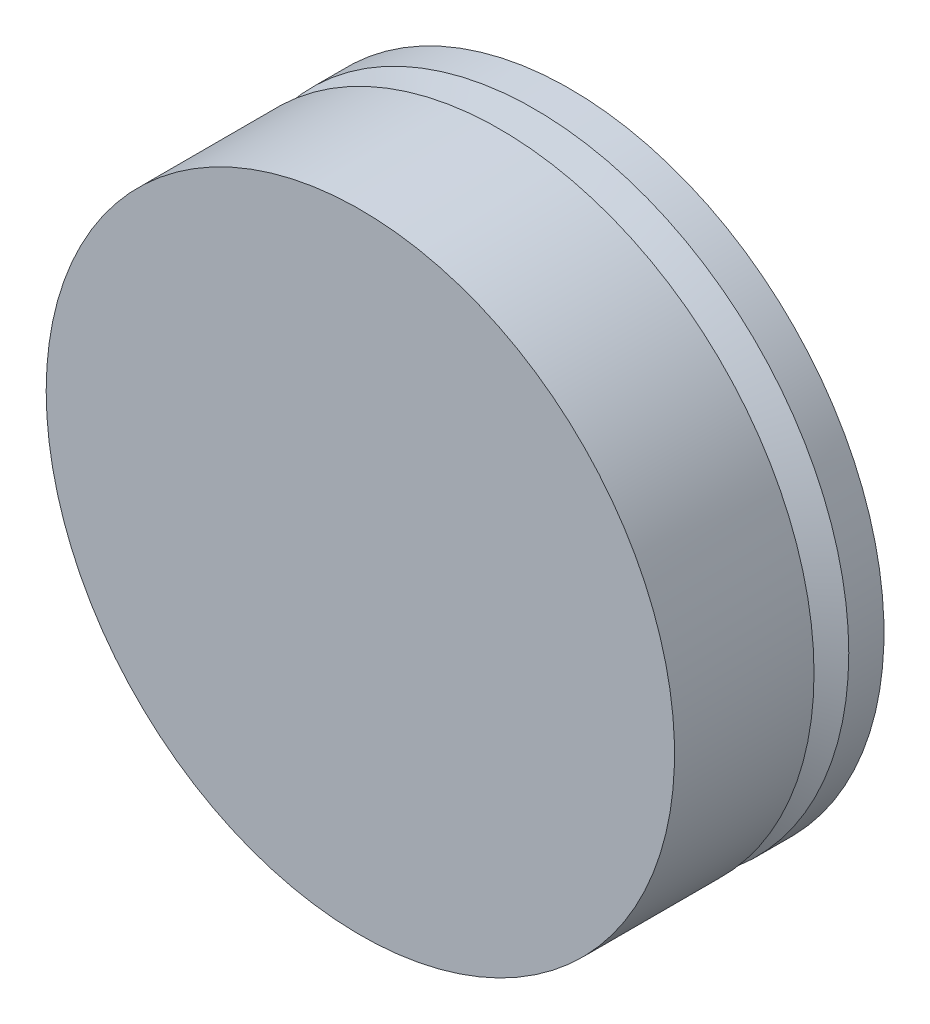
ISO-10303-21;
HEADER;
FILE_DESCRIPTION(('STEP AP214'),'2;1');
FILE_NAME('part.step','',(''),(''),'','','');
FILE_SCHEMA(('AUTOMOTIVE_DESIGN { 1 0 10303 214 1 1 1 1 }'));
ENDSEC;
DATA;
#1=APPLICATION_CONTEXT('core data for automotive mechanical design processes');
#2=APPLICATION_PROTOCOL_DEFINITION('international standard','automotive_design',2000,#1);
#3=PRODUCT_CONTEXT('',#1,'mechanical');
#4=PRODUCT('Part','Part','',(#3));
#5=PRODUCT_RELATED_PRODUCT_CATEGORY('part','',(#4));
#6=PRODUCT_DEFINITION_FORMATION('','',#4);
#7=PRODUCT_DEFINITION_CONTEXT('part definition',#1,'design');
#8=PRODUCT_DEFINITION('design','',#6,#7);
#9=PRODUCT_DEFINITION_SHAPE('','',#8);
#10=(LENGTH_UNIT() NAMED_UNIT(*) SI_UNIT(.MILLI.,.METRE.));
#11=(NAMED_UNIT(*) PLANE_ANGLE_UNIT() SI_UNIT($,.RADIAN.));
#12=(NAMED_UNIT(*) SI_UNIT($,.STERADIAN.) SOLID_ANGLE_UNIT());
#13=UNCERTAINTY_MEASURE_WITH_UNIT(LENGTH_MEASURE(1.E-05),#10,'distance_accuracy_value','');
#14=(GEOMETRIC_REPRESENTATION_CONTEXT(3) GLOBAL_UNCERTAINTY_ASSIGNED_CONTEXT((#13)) GLOBAL_UNIT_ASSIGNED_CONTEXT((#10,
#11,#12)) REPRESENTATION_CONTEXT('',''));
#15=CARTESIAN_POINT('',(0.,0.,0.));
#16=DIRECTION('',(0.,0.,1.));
#17=DIRECTION('',(1.,0.,0.));
#18=AXIS2_PLACEMENT_3D('',#15,#16,#17);
#19=CARTESIAN_POINT('',(0.,6.,10.));
#20=DIRECTION('',(0.,0.,-1.));
#21=DIRECTION('',(-1.,0.,0.));
#22=AXIS2_PLACEMENT_3D('',#19,#20,#21);
#23=CYLINDRICAL_SURFACE('',#22,6.);
#24=CARTESIAN_POINT('',(0.,6.,2.));
#25=DIRECTION('',(0.,0.,-1.));
#26=DIRECTION('',(-1.,0.,0.));
#27=AXIS2_PLACEMENT_3D('',#24,#25,#26);
#28=CIRCLE('',#27,6.);
#29=CARTESIAN_POINT('',(-6.,6.,2.));
#30=VERTEX_POINT('',#29);
#31=EDGE_CURVE('E11',#30,#30,#28,.T.);
#32=ORIENTED_EDGE('',*,*,#31,.T.);
#33=EDGE_LOOP('',(#32));
#34=FACE_BOUND('',#33,.T.);
#35=CARTESIAN_POINT('',(0.,6.,-0.663673357980617));
#36=DIRECTION('',(0.,0.,1.));
#37=DIRECTION('',(1.,0.,0.));
#38=AXIS2_PLACEMENT_3D('',#35,#36,#37);
#39=CIRCLE('',#38,6.);
#40=CARTESIAN_POINT('',(6.,6.,-0.663673357980617));
#41=VERTEX_POINT('',#40);
#42=EDGE_CURVE('E53',#41,#41,#39,.T.);
#43=ORIENTED_EDGE('',*,*,#42,.T.);
#44=EDGE_LOOP('',(#43));
#45=FACE_BOUND('',#44,.T.);
#46=ADVANCED_FACE('F40',(#34,#45),#23,.T.);
#47=CARTESIAN_POINT('',(-5.99999999999999,12.,2.));
#48=DIRECTION('',(0.,0.,-1.));
#49=DIRECTION('',(-1.,0.,0.));
#50=AXIS2_PLACEMENT_3D('',#47,#48,#49);
#51=PLANE('',#50);
#52=ORIENTED_EDGE('',*,*,#31,.F.);
#53=EDGE_LOOP('',(#52));
#54=FACE_BOUND('',#53,.T.);
#55=ADVANCED_FACE('F81',(#54),#51,.F.);
#56=CARTESIAN_POINT('',(0.,12.,-0.663673357980617));
#57=DIRECTION('',(0.,0.,-1.));
#58=DIRECTION('',(-1.,0.,0.));
#59=AXIS2_PLACEMENT_3D('',#56,#57,#58);
#60=PLANE('',#59);
#61=CARTESIAN_POINT('',(0.,6.,-0.663673357980617));
#62=DIRECTION('',(0.,0.,1.));
#63=DIRECTION('',(1.,0.,0.));
#64=AXIS2_PLACEMENT_3D('',#61,#62,#63);
#65=CIRCLE('',#64,4.775);
#66=CARTESIAN_POINT('',(4.775,6.,-0.663673357980617));
#67=VERTEX_POINT('',#66);
#68=EDGE_CURVE('E58',#67,#67,#65,.T.);
#69=ORIENTED_EDGE('',*,*,#68,.T.);
#70=EDGE_LOOP('',(#69));
#71=FACE_BOUND('',#70,.T.);
#72=ORIENTED_EDGE('',*,*,#42,.F.);
#73=EDGE_LOOP('',(#72));
#74=FACE_BOUND('',#73,.T.);
#75=ADVANCED_FACE('F85',(#71,#74),#60,.T.);
#76=CARTESIAN_POINT('',(0.,6.,-0.663673357980617));
#77=DIRECTION('',(0.,0.,-1.));
#78=DIRECTION('',(-1.,0.,0.));
#79=AXIS2_PLACEMENT_3D('',#76,#77,#78);
#80=CONICAL_SURFACE('',#79,4.775,1.07429046063094);
#81=CARTESIAN_POINT('',(0.,6.,-1.32734671596123));
#82=DIRECTION('',(0.,0.,1.));
#83=DIRECTION('',(1.,0.,0.));
#84=AXIS2_PLACEMENT_3D('',#81,#82,#83);
#85=CIRCLE('',#84,6.);
#86=CARTESIAN_POINT('',(6.,6.,-1.32734671596123));
#87=VERTEX_POINT('',#86);
#88=EDGE_CURVE('E64',#87,#87,#85,.T.);
#89=ORIENTED_EDGE('',*,*,#88,.T.);
#90=EDGE_LOOP('',(#89));
#91=FACE_BOUND('',#90,.T.);
#92=ORIENTED_EDGE('',*,*,#68,.F.);
#93=EDGE_LOOP('',(#92));
#94=FACE_BOUND('',#93,.T.);
#95=ADVANCED_FACE('F69',(#91,#94),#80,.T.);
#96=CARTESIAN_POINT('',(-6.,12.,-2.));
#97=DIRECTION('',(0.,0.,1.));
#98=DIRECTION('',(1.,0.,0.));
#99=AXIS2_PLACEMENT_3D('',#96,#97,#98);
#100=PLANE('',#99);
#101=CARTESIAN_POINT('',(0.,6.,-2.));
#102=DIRECTION('',(0.,0.,-1.));
#103=DIRECTION('',(-1.,0.,0.));
#104=AXIS2_PLACEMENT_3D('',#101,#102,#103);
#105=CIRCLE('',#104,6.);
#106=CARTESIAN_POINT('',(-6.,6.,-2.));
#107=VERTEX_POINT('',#106);
#108=EDGE_CURVE('E48',#107,#107,#105,.T.);
#109=ORIENTED_EDGE('',*,*,#108,.T.);
#110=EDGE_LOOP('',(#109));
#111=FACE_BOUND('',#110,.T.);
#112=ADVANCED_FACE('F42',(#111),#100,.F.);
#113=ORIENTED_EDGE('',*,*,#108,.F.);
#114=EDGE_LOOP('',(#113));
#115=FACE_BOUND('',#114,.T.);
#116=ORIENTED_EDGE('',*,*,#88,.F.);
#117=EDGE_LOOP('',(#116));
#118=FACE_BOUND('',#117,.T.);
#119=ADVANCED_FACE('F72',(#115,#118),#23,.T.);
#120=CLOSED_SHELL('',(#46,#55,#75,#95,#112,#119));
#121=MANIFOLD_SOLID_BREP('B2',#120);
#122=ADVANCED_BREP_SHAPE_REPRESENTATION('',(#18,#121),#14);
#123=SHAPE_DEFINITION_REPRESENTATION(#9,#122);
ENDSEC;
END-ISO-10303-21;
